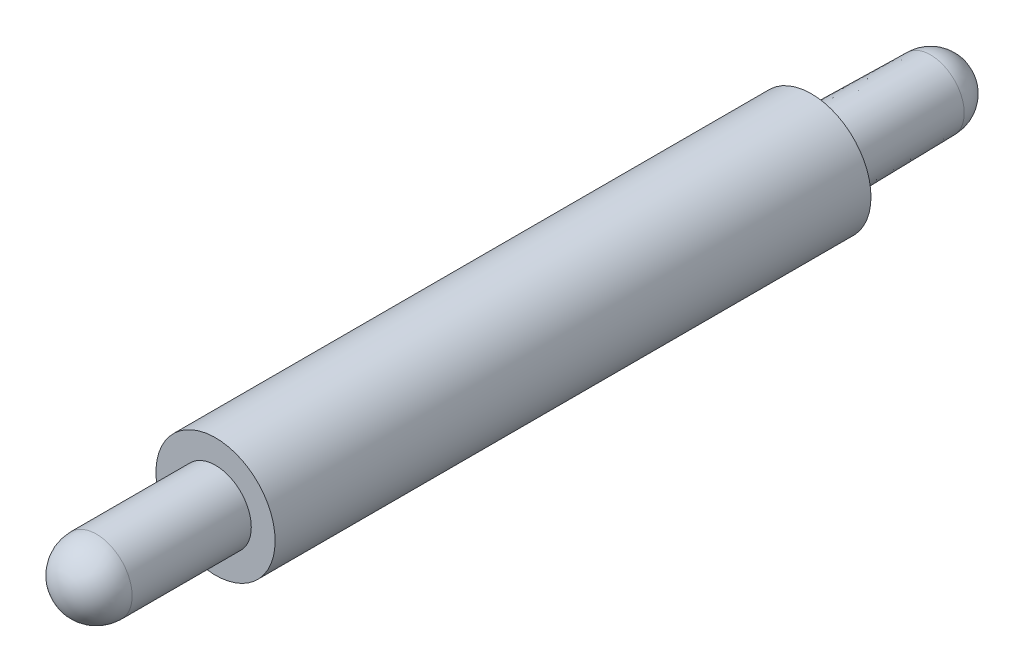
ISO-10303-21;
HEADER;
FILE_DESCRIPTION(('STEP AP214'),'2;1');
FILE_NAME('part.step','',(''),(''),'','','');
FILE_SCHEMA(('AUTOMOTIVE_DESIGN { 1 0 10303 214 1 1 1 1 }'));
ENDSEC;
DATA;
#1=APPLICATION_CONTEXT('core data for automotive mechanical design processes');
#2=APPLICATION_PROTOCOL_DEFINITION('international standard','automotive_design',2000,#1);
#3=PRODUCT_CONTEXT('',#1,'mechanical');
#4=PRODUCT('Part','Part','',(#3));
#5=PRODUCT_RELATED_PRODUCT_CATEGORY('part','',(#4));
#6=PRODUCT_DEFINITION_FORMATION('','',#4);
#7=PRODUCT_DEFINITION_CONTEXT('part definition',#1,'design');
#8=PRODUCT_DEFINITION('design','',#6,#7);
#9=PRODUCT_DEFINITION_SHAPE('','',#8);
#10=(LENGTH_UNIT() NAMED_UNIT(*) SI_UNIT(.MILLI.,.METRE.));
#11=(NAMED_UNIT(*) PLANE_ANGLE_UNIT() SI_UNIT($,.RADIAN.));
#12=(NAMED_UNIT(*) SI_UNIT($,.STERADIAN.) SOLID_ANGLE_UNIT());
#13=UNCERTAINTY_MEASURE_WITH_UNIT(LENGTH_MEASURE(1.E-05),#10,'distance_accuracy_value','');
#14=(GEOMETRIC_REPRESENTATION_CONTEXT(3) GLOBAL_UNCERTAINTY_ASSIGNED_CONTEXT((#13)) GLOBAL_UNIT_ASSIGNED_CONTEXT((#10,
#11,#12)) REPRESENTATION_CONTEXT('',''));
#15=CARTESIAN_POINT('',(0.,0.,0.));
#16=DIRECTION('',(0.,0.,1.));
#17=DIRECTION('',(1.,0.,0.));
#18=AXIS2_PLACEMENT_3D('',#15,#16,#17);
#19=CARTESIAN_POINT('',(0.,0.,50.));
#20=DIRECTION('',(0.,0.,-1.));
#21=DIRECTION('',(-1.,0.,0.));
#22=AXIS2_PLACEMENT_3D('',#19,#20,#21);
#23=CYLINDRICAL_SURFACE('',#22,5.);
#24=CARTESIAN_POINT('',(0.,0.,50.));
#25=DIRECTION('',(0.,0.,1.));
#26=DIRECTION('',(1.,0.,0.));
#27=AXIS2_PLACEMENT_3D('',#24,#25,#26);
#28=CIRCLE('',#27,5.);
#29=CARTESIAN_POINT('',(5.,0.,50.));
#30=VERTEX_POINT('',#29);
#31=EDGE_CURVE('E51',#30,#30,#28,.T.);
#32=ORIENTED_EDGE('',*,*,#31,.F.);
#33=EDGE_LOOP('',(#32));
#34=FACE_BOUND('',#33,.T.);
#35=CARTESIAN_POINT('',(0.,0.,0.));
#36=DIRECTION('',(0.,0.,1.));
#37=DIRECTION('',(1.,0.,0.));
#38=AXIS2_PLACEMENT_3D('',#35,#36,#37);
#39=CIRCLE('',#38,5.);
#40=CARTESIAN_POINT('',(5.,0.,0.));
#41=VERTEX_POINT('',#40);
#42=EDGE_CURVE('E42',#41,#41,#39,.T.);
#43=ORIENTED_EDGE('',*,*,#42,.T.);
#44=EDGE_LOOP('',(#43));
#45=FACE_BOUND('',#44,.T.);
#46=ADVANCED_FACE('F39',(#34,#45),#23,.T.);
#47=CARTESIAN_POINT('',(0.,0.,50.));
#48=DIRECTION('',(0.,0.,1.));
#49=DIRECTION('',(1.,0.,0.));
#50=AXIS2_PLACEMENT_3D('',#47,#48,#49);
#51=PLANE('',#50);
#52=CARTESIAN_POINT('',(0.,0.,50.));
#53=DIRECTION('',(0.,0.,1.));
#54=DIRECTION('',(1.,0.,0.));
#55=AXIS2_PLACEMENT_3D('',#52,#53,#54);
#56=CIRCLE('',#55,3.);
#57=CARTESIAN_POINT('',(3.,0.,50.));
#58=VERTEX_POINT('',#57);
#59=EDGE_CURVE('E10',#58,#58,#56,.T.);
#60=ORIENTED_EDGE('',*,*,#59,.F.);
#61=EDGE_LOOP('',(#60));
#62=FACE_BOUND('',#61,.T.);
#63=ORIENTED_EDGE('',*,*,#31,.T.);
#64=EDGE_LOOP('',(#63));
#65=FACE_BOUND('',#64,.T.);
#66=ADVANCED_FACE('F68',(#62,#65),#51,.T.);
#67=CARTESIAN_POINT('',(0.,0.,0.));
#68=DIRECTION('',(0.,0.,1.));
#69=DIRECTION('',(1.,0.,0.));
#70=AXIS2_PLACEMENT_3D('',#67,#68,#69);
#71=PLANE('',#70);
#72=CARTESIAN_POINT('',(0.,0.,0.));
#73=DIRECTION('',(0.,0.,-1.));
#74=DIRECTION('',(-1.,0.,0.));
#75=AXIS2_PLACEMENT_3D('',#72,#73,#74);
#76=CIRCLE('',#75,3.);
#77=CARTESIAN_POINT('',(-3.,0.,0.));
#78=VERTEX_POINT('',#77);
#79=EDGE_CURVE('E46',#78,#78,#76,.T.);
#80=ORIENTED_EDGE('',*,*,#79,.F.);
#81=EDGE_LOOP('',(#80));
#82=FACE_BOUND('',#81,.T.);
#83=ORIENTED_EDGE('',*,*,#42,.F.);
#84=EDGE_LOOP('',(#83));
#85=FACE_BOUND('',#84,.T.);
#86=ADVANCED_FACE('F65',(#82,#85),#71,.F.);
#87=CARTESIAN_POINT('',(0.,0.,0.));
#88=DIRECTION('',(0.,0.,1.));
#89=DIRECTION('',(-1.,0.,0.));
#90=AXIS2_PLACEMENT_3D('',#87,#88,#89);
#91=CONICAL_SURFACE('',#90,3.,0.0174532925199433);
#92=CARTESIAN_POINT('',(0.,0.,-10.));
#93=DIRECTION('',(0.,0.,-1.));
#94=DIRECTION('',(-1.,0.,0.));
#95=AXIS2_PLACEMENT_3D('',#92,#93,#94);
#96=CIRCLE('',#95,2.82544935071782);
#97=CARTESIAN_POINT('',(-2.82544935071782,0.,-10.));
#98=VERTEX_POINT('',#97);
#99=EDGE_CURVE('E56',#98,#98,#96,.T.);
#100=ORIENTED_EDGE('',*,*,#99,.F.);
#101=EDGE_LOOP('',(#100));
#102=FACE_BOUND('',#101,.T.);
#103=ORIENTED_EDGE('',*,*,#79,.T.);
#104=EDGE_LOOP('',(#103));
#105=FACE_BOUND('',#104,.T.);
#106=ADVANCED_FACE('F67',(#102,#105),#91,.T.);
#107=CARTESIAN_POINT('',(0.,0.,-10.));
#108=DIRECTION('',(0.,1.,0.));
#109=DIRECTION('',(-1.,0.,0.));
#110=AXIS2_PLACEMENT_3D('',#107,#108,#109);
#111=SPHERICAL_SURFACE('',#110,2.82544935071782);
#112=CARTESIAN_POINT('',(0.,0.,-10.));
#113=DIRECTION('',(0.,0.,-1.));
#114=DIRECTION('',(-1.,0.,0.));
#115=AXIS2_PLACEMENT_3D('',#112,#113,#114);
#116=SPHERICAL_SURFACE('',#115,2.82544935071782);
#117=ORIENTED_EDGE('',*,*,#99,.T.);
#118=EDGE_LOOP('',(#117));
#119=FACE_BOUND('',#118,.T.);
#120=ADVANCED_FACE('F74',(#119),#116,.T.);
#121=CARTESIAN_POINT('',(0.,0.,60.));
#122=DIRECTION('',(0.,0.,-1.));
#123=DIRECTION('',(-1.,0.,0.));
#124=AXIS2_PLACEMENT_3D('',#121,#122,#123);
#125=CYLINDRICAL_SURFACE('',#124,3.);
#126=CARTESIAN_POINT('',(0.,0.,60.));
#127=DIRECTION('',(0.,0.,1.));
#128=DIRECTION('',(1.,0.,0.));
#129=AXIS2_PLACEMENT_3D('',#126,#127,#128);
#130=CIRCLE('',#129,3.);
#131=CARTESIAN_POINT('',(3.,0.,60.));
#132=VERTEX_POINT('',#131);
#133=EDGE_CURVE('E54',#132,#132,#130,.T.);
#134=ORIENTED_EDGE('',*,*,#133,.F.);
#135=EDGE_LOOP('',(#134));
#136=FACE_BOUND('',#135,.T.);
#137=ORIENTED_EDGE('',*,*,#59,.T.);
#138=EDGE_LOOP('',(#137));
#139=FACE_BOUND('',#138,.T.);
#140=ADVANCED_FACE('F111',(#136,#139),#125,.T.);
#141=CARTESIAN_POINT('',(0.,0.,60.));
#142=DIRECTION('',(0.,1.,0.));
#143=DIRECTION('',(1.,0.,0.));
#144=AXIS2_PLACEMENT_3D('',#141,#142,#143);
#145=SPHERICAL_SURFACE('',#144,3.);
#146=CARTESIAN_POINT('',(0.,0.,60.));
#147=DIRECTION('',(0.,0.,1.));
#148=DIRECTION('',(1.,0.,0.));
#149=AXIS2_PLACEMENT_3D('',#146,#147,#148);
#150=SPHERICAL_SURFACE('',#149,3.);
#151=ORIENTED_EDGE('',*,*,#133,.T.);
#152=EDGE_LOOP('',(#151));
#153=FACE_BOUND('',#152,.T.);
#154=ADVANCED_FACE('F120',(#153),#150,.T.);
#155=CLOSED_SHELL('',(#46,#66,#86,#106,#120,#140,#154));
#156=MANIFOLD_SOLID_BREP('B2',#155);
#157=ADVANCED_BREP_SHAPE_REPRESENTATION('',(#18,#156),#14);
#158=SHAPE_DEFINITION_REPRESENTATION(#9,#157);
ENDSEC;
END-ISO-10303-21;
